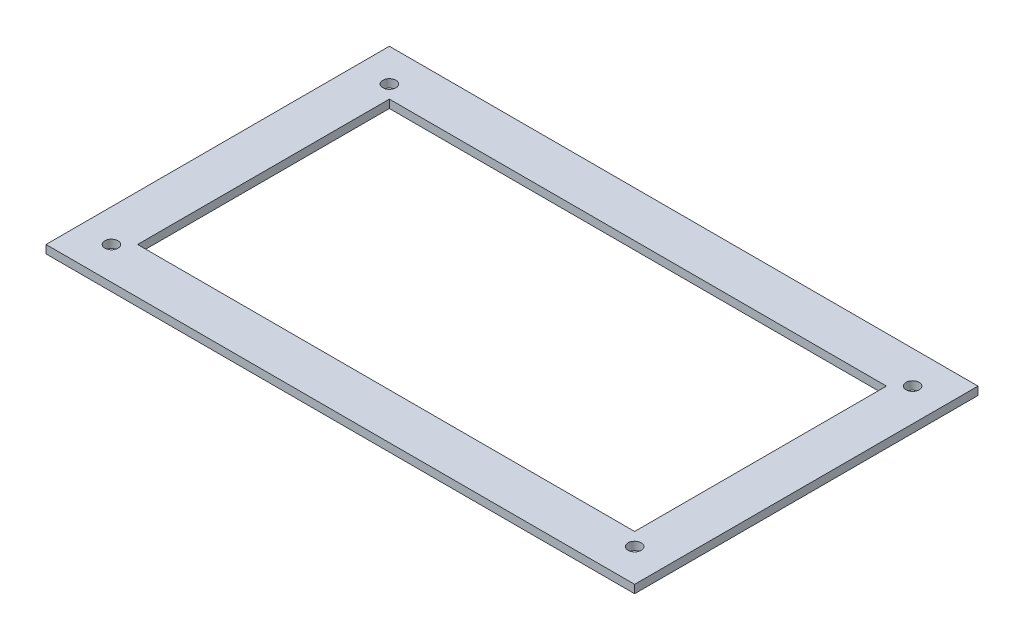
ISO-10303-21;
HEADER;
FILE_DESCRIPTION(('STEP AP214'),'2;1');
FILE_NAME('part.step','',(''),(''),'','','');
FILE_SCHEMA(('AUTOMOTIVE_DESIGN { 1 0 10303 214 1 1 1 1 }'));
ENDSEC;
DATA;
#1=APPLICATION_CONTEXT('core data for automotive mechanical design processes');
#2=APPLICATION_PROTOCOL_DEFINITION('international standard','automotive_design',2000,#1);
#3=PRODUCT_CONTEXT('',#1,'mechanical');
#4=PRODUCT('Part','Part','',(#3));
#5=PRODUCT_RELATED_PRODUCT_CATEGORY('part','',(#4));
#6=PRODUCT_DEFINITION_FORMATION('','',#4);
#7=PRODUCT_DEFINITION_CONTEXT('part definition',#1,'design');
#8=PRODUCT_DEFINITION('design','',#6,#7);
#9=PRODUCT_DEFINITION_SHAPE('','',#8);
#10=(LENGTH_UNIT() NAMED_UNIT(*) SI_UNIT(.MILLI.,.METRE.));
#11=(NAMED_UNIT(*) PLANE_ANGLE_UNIT() SI_UNIT($,.RADIAN.));
#12=(NAMED_UNIT(*) SI_UNIT($,.STERADIAN.) SOLID_ANGLE_UNIT());
#13=UNCERTAINTY_MEASURE_WITH_UNIT(LENGTH_MEASURE(1.E-05),#10,'distance_accuracy_value','');
#14=(GEOMETRIC_REPRESENTATION_CONTEXT(3) GLOBAL_UNCERTAINTY_ASSIGNED_CONTEXT((#13)) GLOBAL_UNIT_ASSIGNED_CONTEXT((#10,
#11,#12)) REPRESENTATION_CONTEXT('',''));
#15=CARTESIAN_POINT('',(0.,0.,0.));
#16=DIRECTION('',(0.,0.,1.));
#17=DIRECTION('',(1.,0.,0.));
#18=AXIS2_PLACEMENT_3D('',#15,#16,#17);
#19=CARTESIAN_POINT('',(0.,5.,0.));
#20=DIRECTION('',(0.,-1.,0.));
#21=DIRECTION('',(0.,0.,-1.));
#22=AXIS2_PLACEMENT_3D('',#19,#20,#21);
#23=PLANE('',#22);
#24=CARTESIAN_POINT('',(-160.,5.,-85.));
#25=DIRECTION('',(0.,1.,0.));
#26=DIRECTION('',(0.,0.,1.));
#27=AXIS2_PLACEMENT_3D('',#24,#25,#26);
#28=CIRCLE('',#27,3.99999999999999);
#29=CARTESIAN_POINT('',(-160.,5.,-81.));
#30=VERTEX_POINT('',#29);
#31=EDGE_CURVE('E304',#30,#30,#28,.T.);
#32=ORIENTED_EDGE('',*,*,#31,.F.);
#33=EDGE_LOOP('',(#32));
#34=FACE_BOUND('',#33,.T.);
#35=CARTESIAN_POINT('',(160.,5.,-85.));
#36=DIRECTION('',(0.,1.,0.));
#37=DIRECTION('',(0.,0.,1.));
#38=AXIS2_PLACEMENT_3D('',#35,#36,#37);
#39=CIRCLE('',#38,3.99999999999999);
#40=CARTESIAN_POINT('',(160.,5.,-81.));
#41=VERTEX_POINT('',#40);
#42=EDGE_CURVE('E302',#41,#41,#39,.T.);
#43=ORIENTED_EDGE('',*,*,#42,.F.);
#44=EDGE_LOOP('',(#43));
#45=FACE_BOUND('',#44,.T.);
#46=CARTESIAN_POINT('',(160.,5.,85.));
#47=DIRECTION('',(0.,1.,0.));
#48=DIRECTION('',(0.,0.,1.));
#49=AXIS2_PLACEMENT_3D('',#46,#47,#48);
#50=CIRCLE('',#49,3.99999999999999);
#51=CARTESIAN_POINT('',(160.,5.,89.));
#52=VERTEX_POINT('',#51);
#53=EDGE_CURVE('E303',#52,#52,#50,.T.);
#54=ORIENTED_EDGE('',*,*,#53,.F.);
#55=EDGE_LOOP('',(#54));
#56=FACE_BOUND('',#55,.T.);
#57=CARTESIAN_POINT('',(-160.,5.,85.));
#58=DIRECTION('',(0.,1.,0.));
#59=DIRECTION('',(0.,0.,1.));
#60=AXIS2_PLACEMENT_3D('',#57,#58,#59);
#61=CIRCLE('',#60,3.99999999999999);
#62=CARTESIAN_POINT('',(-160.,5.,89.));
#63=VERTEX_POINT('',#62);
#64=EDGE_CURVE('E172',#63,#63,#61,.T.);
#65=ORIENTED_EDGE('',*,*,#64,.F.);
#66=EDGE_LOOP('',(#65));
#67=FACE_BOUND('',#66,.T.);
#68=DIRECTION('',(0.,0.,-1.));
#69=VECTOR('',#68,1.);
#70=CARTESIAN_POINT('',(180.,5.,105.));
#71=LINE('',#70,#69);
#72=CARTESIAN_POINT('',(180.,5.,105.));
#73=VERTEX_POINT('',#72);
#74=CARTESIAN_POINT('',(180.,5.,-105.));
#75=VERTEX_POINT('',#74);
#76=EDGE_CURVE('E143',#73,#75,#71,.T.);
#77=ORIENTED_EDGE('',*,*,#76,.T.);
#78=DIRECTION('',(-1.,0.,0.));
#79=VECTOR('',#78,1.);
#80=CARTESIAN_POINT('',(-180.,5.,-105.));
#81=LINE('',#80,#79);
#82=CARTESIAN_POINT('',(-180.,5.,-105.));
#83=VERTEX_POINT('',#82);
#84=EDGE_CURVE('E146',#75,#83,#81,.T.);
#85=ORIENTED_EDGE('',*,*,#84,.T.);
#86=DIRECTION('',(0.,0.,1.));
#87=VECTOR('',#86,1.);
#88=CARTESIAN_POINT('',(-180.,5.,105.));
#89=LINE('',#88,#87);
#90=CARTESIAN_POINT('',(-180.,5.,105.));
#91=VERTEX_POINT('',#90);
#92=EDGE_CURVE('E149',#83,#91,#89,.T.);
#93=ORIENTED_EDGE('',*,*,#92,.T.);
#94=DIRECTION('',(1.,0.,0.));
#95=VECTOR('',#94,1.);
#96=CARTESIAN_POINT('',(-180.,5.,105.));
#97=LINE('',#96,#95);
#98=EDGE_CURVE('E151',#91,#73,#97,.T.);
#99=ORIENTED_EDGE('',*,*,#98,.T.);
#100=EDGE_LOOP('',(#77,#85,#93,#99));
#101=FACE_BOUND('',#100,.T.);
#102=DIRECTION('',(0.,0.,-1.));
#103=VECTOR('',#102,1.);
#104=CARTESIAN_POINT('',(152.,5.,77.));
#105=LINE('',#104,#103);
#106=CARTESIAN_POINT('',(152.,5.,77.));
#107=VERTEX_POINT('',#106);
#108=CARTESIAN_POINT('',(152.,5.,-77.));
#109=VERTEX_POINT('',#108);
#110=EDGE_CURVE('E106',#107,#109,#105,.T.);
#111=ORIENTED_EDGE('',*,*,#110,.F.);
#112=DIRECTION('',(1.,0.,0.));
#113=VECTOR('',#112,1.);
#114=CARTESIAN_POINT('',(-152.,5.,77.));
#115=LINE('',#114,#113);
#116=CARTESIAN_POINT('',(-152.,5.,77.));
#117=VERTEX_POINT('',#116);
#118=EDGE_CURVE('E128',#117,#107,#115,.T.);
#119=ORIENTED_EDGE('',*,*,#118,.F.);
#120=DIRECTION('',(0.,0.,1.));
#121=VECTOR('',#120,1.);
#122=CARTESIAN_POINT('',(-152.,5.,77.));
#123=LINE('',#122,#121);
#124=CARTESIAN_POINT('',(-152.,5.,-77.));
#125=VERTEX_POINT('',#124);
#126=EDGE_CURVE('E126',#125,#117,#123,.T.);
#127=ORIENTED_EDGE('',*,*,#126,.F.);
#128=DIRECTION('',(-1.,0.,0.));
#129=VECTOR('',#128,1.);
#130=CARTESIAN_POINT('',(-152.,5.,-77.));
#131=LINE('',#130,#129);
#132=EDGE_CURVE('E114',#109,#125,#131,.T.);
#133=ORIENTED_EDGE('',*,*,#132,.F.);
#134=EDGE_LOOP('',(#111,#119,#127,#133));
#135=FACE_BOUND('',#134,.T.);
#136=ADVANCED_FACE('F39',(#34,#45,#56,#67,#101,#135),#23,.F.);
#137=CARTESIAN_POINT('',(0.,0.,0.));
#138=DIRECTION('',(0.,-1.,0.));
#139=DIRECTION('',(0.,0.,-1.));
#140=AXIS2_PLACEMENT_3D('',#137,#138,#139);
#141=PLANE('',#140);
#142=CARTESIAN_POINT('',(-160.,0.,-85.));
#143=DIRECTION('',(0.,-1.,0.));
#144=DIRECTION('',(0.,0.,-1.));
#145=AXIS2_PLACEMENT_3D('',#142,#143,#144);
#146=CIRCLE('',#145,3.99999999999999);
#147=CARTESIAN_POINT('',(-160.,0.,-89.));
#148=VERTEX_POINT('',#147);
#149=EDGE_CURVE('E43',#148,#148,#146,.T.);
#150=ORIENTED_EDGE('',*,*,#149,.F.);
#151=EDGE_LOOP('',(#150));
#152=FACE_BOUND('',#151,.T.);
#153=CARTESIAN_POINT('',(160.,0.,-85.));
#154=DIRECTION('',(0.,-1.,0.));
#155=DIRECTION('',(0.,0.,-1.));
#156=AXIS2_PLACEMENT_3D('',#153,#154,#155);
#157=CIRCLE('',#156,3.99999999999999);
#158=CARTESIAN_POINT('',(160.,0.,-89.));
#159=VERTEX_POINT('',#158);
#160=EDGE_CURVE('E174',#159,#159,#157,.T.);
#161=ORIENTED_EDGE('',*,*,#160,.F.);
#162=EDGE_LOOP('',(#161));
#163=FACE_BOUND('',#162,.T.);
#164=CARTESIAN_POINT('',(160.,0.,85.));
#165=DIRECTION('',(0.,-1.,0.));
#166=DIRECTION('',(0.,0.,-1.));
#167=AXIS2_PLACEMENT_3D('',#164,#165,#166);
#168=CIRCLE('',#167,3.99999999999999);
#169=CARTESIAN_POINT('',(160.,0.,81.));
#170=VERTEX_POINT('',#169);
#171=EDGE_CURVE('E171',#170,#170,#168,.T.);
#172=ORIENTED_EDGE('',*,*,#171,.F.);
#173=EDGE_LOOP('',(#172));
#174=FACE_BOUND('',#173,.T.);
#175=CARTESIAN_POINT('',(-160.,0.,85.));
#176=DIRECTION('',(0.,-1.,0.));
#177=DIRECTION('',(0.,0.,-1.));
#178=AXIS2_PLACEMENT_3D('',#175,#176,#177);
#179=CIRCLE('',#178,3.99999999999999);
#180=CARTESIAN_POINT('',(-160.,0.,81.));
#181=VERTEX_POINT('',#180);
#182=EDGE_CURVE('E168',#181,#181,#179,.T.);
#183=ORIENTED_EDGE('',*,*,#182,.F.);
#184=EDGE_LOOP('',(#183));
#185=FACE_BOUND('',#184,.T.);
#186=DIRECTION('',(0.,0.,-1.));
#187=VECTOR('',#186,1.);
#188=CARTESIAN_POINT('',(180.,0.,105.));
#189=LINE('',#188,#187);
#190=CARTESIAN_POINT('',(180.,0.,105.));
#191=VERTEX_POINT('',#190);
#192=CARTESIAN_POINT('',(180.,0.,-105.));
#193=VERTEX_POINT('',#192);
#194=EDGE_CURVE('E122',#191,#193,#189,.T.);
#195=ORIENTED_EDGE('',*,*,#194,.F.);
#196=DIRECTION('',(1.,0.,0.));
#197=VECTOR('',#196,1.);
#198=CARTESIAN_POINT('',(-180.,0.,105.));
#199=LINE('',#198,#197);
#200=CARTESIAN_POINT('',(-180.,0.,105.));
#201=VERTEX_POINT('',#200);
#202=EDGE_CURVE('E147',#201,#191,#199,.T.);
#203=ORIENTED_EDGE('',*,*,#202,.F.);
#204=DIRECTION('',(0.,0.,1.));
#205=VECTOR('',#204,1.);
#206=CARTESIAN_POINT('',(-180.,0.,105.));
#207=LINE('',#206,#205);
#208=CARTESIAN_POINT('',(-180.,0.,-105.));
#209=VERTEX_POINT('',#208);
#210=EDGE_CURVE('E158',#209,#201,#207,.T.);
#211=ORIENTED_EDGE('',*,*,#210,.F.);
#212=DIRECTION('',(-1.,0.,0.));
#213=VECTOR('',#212,1.);
#214=CARTESIAN_POINT('',(-180.,0.,-105.));
#215=LINE('',#214,#213);
#216=EDGE_CURVE('E156',#193,#209,#215,.T.);
#217=ORIENTED_EDGE('',*,*,#216,.F.);
#218=EDGE_LOOP('',(#195,#203,#211,#217));
#219=FACE_BOUND('',#218,.T.);
#220=DIRECTION('',(1.,0.,0.));
#221=VECTOR('',#220,1.);
#222=CARTESIAN_POINT('',(-152.,0.,77.));
#223=LINE('',#222,#221);
#224=CARTESIAN_POINT('',(-152.,0.,77.));
#225=VERTEX_POINT('',#224);
#226=CARTESIAN_POINT('',(152.,0.,77.));
#227=VERTEX_POINT('',#226);
#228=EDGE_CURVE('E115',#225,#227,#223,.T.);
#229=ORIENTED_EDGE('',*,*,#228,.T.);
#230=DIRECTION('',(0.,0.,-1.));
#231=VECTOR('',#230,1.);
#232=CARTESIAN_POINT('',(152.,0.,77.));
#233=LINE('',#232,#231);
#234=CARTESIAN_POINT('',(152.,0.,-77.));
#235=VERTEX_POINT('',#234);
#236=EDGE_CURVE('E64',#227,#235,#233,.T.);
#237=ORIENTED_EDGE('',*,*,#236,.T.);
#238=DIRECTION('',(-1.,0.,0.));
#239=VECTOR('',#238,1.);
#240=CARTESIAN_POINT('',(-152.,0.,-77.));
#241=LINE('',#240,#239);
#242=CARTESIAN_POINT('',(-152.,0.,-77.));
#243=VERTEX_POINT('',#242);
#244=EDGE_CURVE('E121',#235,#243,#241,.T.);
#245=ORIENTED_EDGE('',*,*,#244,.T.);
#246=DIRECTION('',(0.,0.,1.));
#247=VECTOR('',#246,1.);
#248=CARTESIAN_POINT('',(-152.,0.,77.));
#249=LINE('',#248,#247);
#250=EDGE_CURVE('E135',#243,#225,#249,.T.);
#251=ORIENTED_EDGE('',*,*,#250,.T.);
#252=EDGE_LOOP('',(#229,#237,#245,#251));
#253=FACE_BOUND('',#252,.T.);
#254=ADVANCED_FACE('F184',(#152,#163,#174,#185,#219,#253),#141,.T.);
#255=CARTESIAN_POINT('',(180.,5.,105.));
#256=DIRECTION('',(-1.,0.,0.));
#257=DIRECTION('',(0.,0.,1.));
#258=AXIS2_PLACEMENT_3D('',#255,#256,#257);
#259=PLANE('',#258);
#260=ORIENTED_EDGE('',*,*,#194,.T.);
#261=DIRECTION('',(0.,-1.,0.));
#262=VECTOR('',#261,1.);
#263=CARTESIAN_POINT('',(180.,5.,-105.));
#264=LINE('',#263,#262);
#265=EDGE_CURVE('E11',#75,#193,#264,.T.);
#266=ORIENTED_EDGE('',*,*,#265,.F.);
#267=ORIENTED_EDGE('',*,*,#76,.F.);
#268=DIRECTION('',(0.,-1.,0.));
#269=VECTOR('',#268,1.);
#270=CARTESIAN_POINT('',(180.,5.,105.));
#271=LINE('',#270,#269);
#272=EDGE_CURVE('E153',#73,#191,#271,.T.);
#273=ORIENTED_EDGE('',*,*,#272,.T.);
#274=EDGE_LOOP('',(#260,#266,#267,#273));
#275=FACE_BOUND('',#274,.T.);
#276=ADVANCED_FACE('F41',(#275),#259,.F.);
#277=CARTESIAN_POINT('',(-180.,5.,-105.));
#278=DIRECTION('',(0.,0.,1.));
#279=DIRECTION('',(1.,0.,0.));
#280=AXIS2_PLACEMENT_3D('',#277,#278,#279);
#281=PLANE('',#280);
#282=ORIENTED_EDGE('',*,*,#216,.T.);
#283=DIRECTION('',(0.,-1.,0.));
#284=VECTOR('',#283,1.);
#285=CARTESIAN_POINT('',(-180.,5.,-105.));
#286=LINE('',#285,#284);
#287=EDGE_CURVE('E48',#83,#209,#286,.T.);
#288=ORIENTED_EDGE('',*,*,#287,.F.);
#289=ORIENTED_EDGE('',*,*,#84,.F.);
#290=ORIENTED_EDGE('',*,*,#265,.T.);
#291=EDGE_LOOP('',(#282,#288,#289,#290));
#292=FACE_BOUND('',#291,.T.);
#293=ADVANCED_FACE('F227',(#292),#281,.F.);
#294=CARTESIAN_POINT('',(-180.,5.,105.));
#295=DIRECTION('',(1.,0.,0.));
#296=DIRECTION('',(0.,0.,-1.));
#297=AXIS2_PLACEMENT_3D('',#294,#295,#296);
#298=PLANE('',#297);
#299=ORIENTED_EDGE('',*,*,#210,.T.);
#300=DIRECTION('',(0.,-1.,0.));
#301=VECTOR('',#300,1.);
#302=CARTESIAN_POINT('',(-180.,5.,105.));
#303=LINE('',#302,#301);
#304=EDGE_CURVE('E163',#91,#201,#303,.T.);
#305=ORIENTED_EDGE('',*,*,#304,.F.);
#306=ORIENTED_EDGE('',*,*,#92,.F.);
#307=ORIENTED_EDGE('',*,*,#287,.T.);
#308=EDGE_LOOP('',(#299,#305,#306,#307));
#309=FACE_BOUND('',#308,.T.);
#310=ADVANCED_FACE('F224',(#309),#298,.F.);
#311=CARTESIAN_POINT('',(-180.,5.,105.));
#312=DIRECTION('',(0.,0.,-1.));
#313=DIRECTION('',(-1.,0.,0.));
#314=AXIS2_PLACEMENT_3D('',#311,#312,#313);
#315=PLANE('',#314);
#316=ORIENTED_EDGE('',*,*,#202,.T.);
#317=ORIENTED_EDGE('',*,*,#272,.F.);
#318=ORIENTED_EDGE('',*,*,#98,.F.);
#319=ORIENTED_EDGE('',*,*,#304,.T.);
#320=EDGE_LOOP('',(#316,#317,#318,#319));
#321=FACE_BOUND('',#320,.T.);
#322=ADVANCED_FACE('F221',(#321),#315,.F.);
#323=CARTESIAN_POINT('',(152.,5.,77.));
#324=DIRECTION('',(-1.,0.,0.));
#325=DIRECTION('',(0.,0.,1.));
#326=AXIS2_PLACEMENT_3D('',#323,#324,#325);
#327=PLANE('',#326);
#328=ORIENTED_EDGE('',*,*,#236,.F.);
#329=DIRECTION('',(0.,-1.,0.));
#330=VECTOR('',#329,1.);
#331=CARTESIAN_POINT('',(152.,5.,77.));
#332=LINE('',#331,#330);
#333=EDGE_CURVE('E110',#107,#227,#332,.T.);
#334=ORIENTED_EDGE('',*,*,#333,.F.);
#335=ORIENTED_EDGE('',*,*,#110,.T.);
#336=DIRECTION('',(0.,-1.,0.));
#337=VECTOR('',#336,1.);
#338=CARTESIAN_POINT('',(152.,5.,-77.));
#339=LINE('',#338,#337);
#340=EDGE_CURVE('E109',#109,#235,#339,.T.);
#341=ORIENTED_EDGE('',*,*,#340,.T.);
#342=EDGE_LOOP('',(#328,#334,#335,#341));
#343=FACE_BOUND('',#342,.T.);
#344=ADVANCED_FACE('F108',(#343),#327,.T.);
#345=CARTESIAN_POINT('',(-152.,5.,-77.));
#346=DIRECTION('',(0.,0.,1.));
#347=DIRECTION('',(1.,0.,0.));
#348=AXIS2_PLACEMENT_3D('',#345,#346,#347);
#349=PLANE('',#348);
#350=ORIENTED_EDGE('',*,*,#244,.F.);
#351=ORIENTED_EDGE('',*,*,#340,.F.);
#352=ORIENTED_EDGE('',*,*,#132,.T.);
#353=DIRECTION('',(0.,-1.,0.));
#354=VECTOR('',#353,1.);
#355=CARTESIAN_POINT('',(-152.,5.,-77.));
#356=LINE('',#355,#354);
#357=EDGE_CURVE('E123',#125,#243,#356,.T.);
#358=ORIENTED_EDGE('',*,*,#357,.T.);
#359=EDGE_LOOP('',(#350,#351,#352,#358));
#360=FACE_BOUND('',#359,.T.);
#361=ADVANCED_FACE('F118',(#360),#349,.T.);
#362=CARTESIAN_POINT('',(-152.,5.,77.));
#363=DIRECTION('',(1.,0.,0.));
#364=DIRECTION('',(0.,0.,-1.));
#365=AXIS2_PLACEMENT_3D('',#362,#363,#364);
#366=PLANE('',#365);
#367=ORIENTED_EDGE('',*,*,#250,.F.);
#368=ORIENTED_EDGE('',*,*,#357,.F.);
#369=ORIENTED_EDGE('',*,*,#126,.T.);
#370=DIRECTION('',(0.,-1.,0.));
#371=VECTOR('',#370,1.);
#372=CARTESIAN_POINT('',(-152.,5.,77.));
#373=LINE('',#372,#371);
#374=EDGE_CURVE('E56',#117,#225,#373,.T.);
#375=ORIENTED_EDGE('',*,*,#374,.T.);
#376=EDGE_LOOP('',(#367,#368,#369,#375));
#377=FACE_BOUND('',#376,.T.);
#378=ADVANCED_FACE('F200',(#377),#366,.T.);
#379=CARTESIAN_POINT('',(-152.,5.,77.));
#380=DIRECTION('',(0.,0.,-1.));
#381=DIRECTION('',(-1.,0.,0.));
#382=AXIS2_PLACEMENT_3D('',#379,#380,#381);
#383=PLANE('',#382);
#384=ORIENTED_EDGE('',*,*,#228,.F.);
#385=ORIENTED_EDGE('',*,*,#374,.F.);
#386=ORIENTED_EDGE('',*,*,#118,.T.);
#387=ORIENTED_EDGE('',*,*,#333,.T.);
#388=EDGE_LOOP('',(#384,#385,#386,#387));
#389=FACE_BOUND('',#388,.T.);
#390=ADVANCED_FACE('F197',(#389),#383,.T.);
#391=CARTESIAN_POINT('',(-160.,-5.,85.));
#392=DIRECTION('',(0.,1.,0.));
#393=DIRECTION('',(0.,0.,1.));
#394=AXIS2_PLACEMENT_3D('',#391,#392,#393);
#395=CYLINDRICAL_SURFACE('',#394,3.99999999999999);
#396=ORIENTED_EDGE('',*,*,#182,.T.);
#397=EDGE_LOOP('',(#396));
#398=FACE_BOUND('',#397,.T.);
#399=ORIENTED_EDGE('',*,*,#64,.T.);
#400=EDGE_LOOP('',(#399));
#401=FACE_BOUND('',#400,.T.);
#402=ADVANCED_FACE('F199',(#398,#401),#395,.F.);
#403=CARTESIAN_POINT('',(160.,-5.,85.));
#404=DIRECTION('',(0.,1.,0.));
#405=DIRECTION('',(0.,0.,1.));
#406=AXIS2_PLACEMENT_3D('',#403,#404,#405);
#407=CYLINDRICAL_SURFACE('',#406,3.99999999999999);
#408=ORIENTED_EDGE('',*,*,#171,.T.);
#409=EDGE_LOOP('',(#408));
#410=FACE_BOUND('',#409,.T.);
#411=ORIENTED_EDGE('',*,*,#53,.T.);
#412=EDGE_LOOP('',(#411));
#413=FACE_BOUND('',#412,.T.);
#414=ADVANCED_FACE('F206',(#410,#413),#407,.F.);
#415=CARTESIAN_POINT('',(160.,-5.,-85.));
#416=DIRECTION('',(0.,1.,0.));
#417=DIRECTION('',(0.,0.,1.));
#418=AXIS2_PLACEMENT_3D('',#415,#416,#417);
#419=CYLINDRICAL_SURFACE('',#418,3.99999999999999);
#420=ORIENTED_EDGE('',*,*,#160,.T.);
#421=EDGE_LOOP('',(#420));
#422=FACE_BOUND('',#421,.T.);
#423=ORIENTED_EDGE('',*,*,#42,.T.);
#424=EDGE_LOOP('',(#423));
#425=FACE_BOUND('',#424,.T.);
#426=ADVANCED_FACE('F271',(#422,#425),#419,.F.);
#427=CARTESIAN_POINT('',(-160.,-5.,-85.));
#428=DIRECTION('',(0.,1.,0.));
#429=DIRECTION('',(0.,0.,1.));
#430=AXIS2_PLACEMENT_3D('',#427,#428,#429);
#431=CYLINDRICAL_SURFACE('',#430,3.99999999999999);
#432=ORIENTED_EDGE('',*,*,#149,.T.);
#433=EDGE_LOOP('',(#432));
#434=FACE_BOUND('',#433,.T.);
#435=ORIENTED_EDGE('',*,*,#31,.T.);
#436=EDGE_LOOP('',(#435));
#437=FACE_BOUND('',#436,.T.);
#438=ADVANCED_FACE('F181',(#434,#437),#431,.F.);
#439=CLOSED_SHELL('',(#136,#254,#276,#293,#310,#322,#344,#361,#378,#390,#402,#414,#426,#438));
#440=MANIFOLD_SOLID_BREP('B2',#439);
#441=ADVANCED_BREP_SHAPE_REPRESENTATION('',(#18,#440),#14);
#442=SHAPE_DEFINITION_REPRESENTATION(#9,#441);
ENDSEC;
END-ISO-10303-21;
